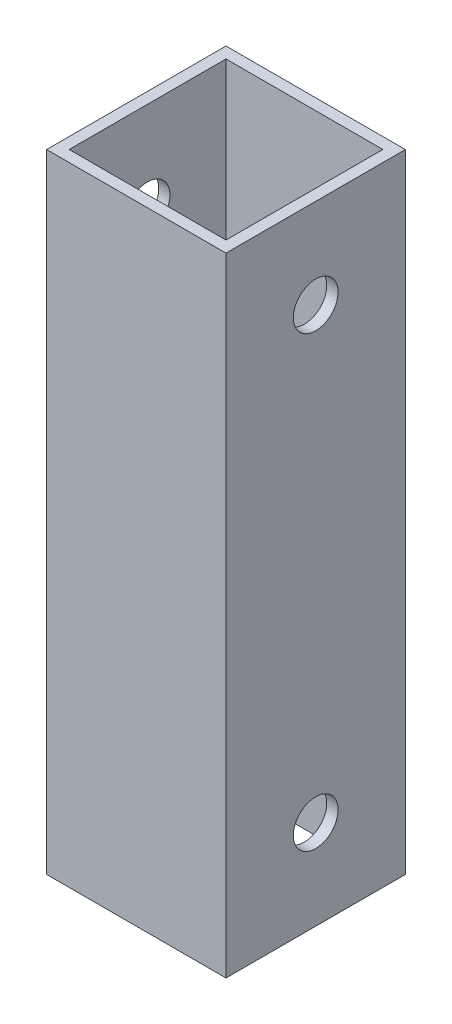
ISO-10303-21;
HEADER;
FILE_DESCRIPTION(('STEP AP214'),'2;1');
FILE_NAME('part.step','',(''),(''),'','','');
FILE_SCHEMA(('AUTOMOTIVE_DESIGN { 1 0 10303 214 1 1 1 1 }'));
ENDSEC;
DATA;
#1=APPLICATION_CONTEXT('core data for automotive mechanical design processes');
#2=APPLICATION_PROTOCOL_DEFINITION('international standard','automotive_design',2000,#1);
#3=PRODUCT_CONTEXT('',#1,'mechanical');
#4=PRODUCT('Part','Part','',(#3));
#5=PRODUCT_RELATED_PRODUCT_CATEGORY('part','',(#4));
#6=PRODUCT_DEFINITION_FORMATION('','',#4);
#7=PRODUCT_DEFINITION_CONTEXT('part definition',#1,'design');
#8=PRODUCT_DEFINITION('design','',#6,#7);
#9=PRODUCT_DEFINITION_SHAPE('','',#8);
#10=(LENGTH_UNIT() NAMED_UNIT(*) SI_UNIT(.MILLI.,.METRE.));
#11=(NAMED_UNIT(*) PLANE_ANGLE_UNIT() SI_UNIT($,.RADIAN.));
#12=(NAMED_UNIT(*) SI_UNIT($,.STERADIAN.) SOLID_ANGLE_UNIT());
#13=UNCERTAINTY_MEASURE_WITH_UNIT(LENGTH_MEASURE(1.E-05),#10,'distance_accuracy_value','');
#14=(GEOMETRIC_REPRESENTATION_CONTEXT(3) GLOBAL_UNCERTAINTY_ASSIGNED_CONTEXT((#13)) GLOBAL_UNIT_ASSIGNED_CONTEXT((#10,
#11,#12)) REPRESENTATION_CONTEXT('',''));
#15=CARTESIAN_POINT('',(0.,0.,0.));
#16=DIRECTION('',(0.,0.,1.));
#17=DIRECTION('',(1.,0.,0.));
#18=AXIS2_PLACEMENT_3D('',#15,#16,#17);
#19=CARTESIAN_POINT('',(0.,177.8,0.));
#20=DIRECTION('',(0.,1.,0.));
#21=DIRECTION('',(0.,0.,1.));
#22=AXIS2_PLACEMENT_3D('',#19,#20,#21);
#23=PLANE('',#22);
#24=DIRECTION('',(0.,0.,1.));
#25=VECTOR('',#24,1.);
#26=CARTESIAN_POINT('',(-25.4,177.8,-25.4));
#27=LINE('',#26,#25);
#28=CARTESIAN_POINT('',(-25.4,177.8,-25.4));
#29=VERTEX_POINT('',#28);
#30=CARTESIAN_POINT('',(-25.4,177.8,25.4));
#31=VERTEX_POINT('',#30);
#32=EDGE_CURVE('E138',#29,#31,#27,.T.);
#33=ORIENTED_EDGE('',*,*,#32,.T.);
#34=DIRECTION('',(1.,0.,0.));
#35=VECTOR('',#34,1.);
#36=CARTESIAN_POINT('',(-25.4,177.8,25.4));
#37=LINE('',#36,#35);
#38=CARTESIAN_POINT('',(25.4,177.8,25.4));
#39=VERTEX_POINT('',#38);
#40=EDGE_CURVE('E141',#31,#39,#37,.T.);
#41=ORIENTED_EDGE('',*,*,#40,.T.);
#42=DIRECTION('',(0.,0.,-1.));
#43=VECTOR('',#42,1.);
#44=CARTESIAN_POINT('',(25.4,177.8,-25.4));
#45=LINE('',#44,#43);
#46=CARTESIAN_POINT('',(25.4,177.8,-25.4));
#47=VERTEX_POINT('',#46);
#48=EDGE_CURVE('E144',#39,#47,#45,.T.);
#49=ORIENTED_EDGE('',*,*,#48,.T.);
#50=DIRECTION('',(-1.,0.,0.));
#51=VECTOR('',#50,1.);
#52=CARTESIAN_POINT('',(-25.4,177.8,-25.4));
#53=LINE('',#52,#51);
#54=EDGE_CURVE('E146',#47,#29,#53,.T.);
#55=ORIENTED_EDGE('',*,*,#54,.T.);
#56=EDGE_LOOP('',(#33,#41,#49,#55));
#57=FACE_BOUND('',#56,.T.);
#58=DIRECTION('',(1.,0.,0.));
#59=VECTOR('',#58,1.);
#60=CARTESIAN_POINT('',(-22.225,177.8,22.1917539267016));
#61=LINE('',#60,#59);
#62=CARTESIAN_POINT('',(-22.225,177.8,22.1917539267016));
#63=VERTEX_POINT('',#62);
#64=CARTESIAN_POINT('',(22.1917539267016,177.8,22.1917539267016));
#65=VERTEX_POINT('',#64);
#66=EDGE_CURVE('E108',#63,#65,#61,.T.);
#67=ORIENTED_EDGE('',*,*,#66,.F.);
#68=DIRECTION('',(0.,0.,1.));
#69=VECTOR('',#68,1.);
#70=CARTESIAN_POINT('',(-22.225,177.8,-22.225));
#71=LINE('',#70,#69);
#72=CARTESIAN_POINT('',(-22.225,177.8,-22.225));
#73=VERTEX_POINT('',#72);
#74=EDGE_CURVE('E100',#73,#63,#71,.T.);
#75=ORIENTED_EDGE('',*,*,#74,.F.);
#76=DIRECTION('',(-1.,0.,0.));
#77=VECTOR('',#76,1.);
#78=CARTESIAN_POINT('',(-22.225,177.8,-22.225));
#79=LINE('',#78,#77);
#80=CARTESIAN_POINT('',(22.1917539267016,177.8,-22.225));
#81=VERTEX_POINT('',#80);
#82=EDGE_CURVE('E122',#81,#73,#79,.T.);
#83=ORIENTED_EDGE('',*,*,#82,.F.);
#84=DIRECTION('',(0.,0.,-1.));
#85=VECTOR('',#84,1.);
#86=CARTESIAN_POINT('',(22.1917539267016,177.8,-22.225));
#87=LINE('',#86,#85);
#88=EDGE_CURVE('E120',#65,#81,#87,.T.);
#89=ORIENTED_EDGE('',*,*,#88,.F.);
#90=EDGE_LOOP('',(#67,#75,#83,#89));
#91=FACE_BOUND('',#90,.T.);
#92=ADVANCED_FACE('F33',(#57,#91),#23,.T.);
#93=CARTESIAN_POINT('',(0.,0.,0.));
#94=DIRECTION('',(0.,1.,0.));
#95=DIRECTION('',(0.,0.,1.));
#96=AXIS2_PLACEMENT_3D('',#93,#94,#95);
#97=PLANE('',#96);
#98=DIRECTION('',(0.,0.,1.));
#99=VECTOR('',#98,1.);
#100=CARTESIAN_POINT('',(-25.4,0.,-25.4));
#101=LINE('',#100,#99);
#102=CARTESIAN_POINT('',(-25.4,0.,-25.4));
#103=VERTEX_POINT('',#102);
#104=CARTESIAN_POINT('',(-25.4,0.,25.4));
#105=VERTEX_POINT('',#104);
#106=EDGE_CURVE('E116',#103,#105,#101,.T.);
#107=ORIENTED_EDGE('',*,*,#106,.F.);
#108=DIRECTION('',(-1.,0.,0.));
#109=VECTOR('',#108,1.);
#110=CARTESIAN_POINT('',(-25.4,0.,-25.4));
#111=LINE('',#110,#109);
#112=CARTESIAN_POINT('',(25.4,0.,-25.4));
#113=VERTEX_POINT('',#112);
#114=EDGE_CURVE('E142',#113,#103,#111,.T.);
#115=ORIENTED_EDGE('',*,*,#114,.F.);
#116=DIRECTION('',(0.,0.,-1.));
#117=VECTOR('',#116,1.);
#118=CARTESIAN_POINT('',(25.4,0.,-25.4));
#119=LINE('',#118,#117);
#120=CARTESIAN_POINT('',(25.4,0.,25.4));
#121=VERTEX_POINT('',#120);
#122=EDGE_CURVE('E153',#121,#113,#119,.T.);
#123=ORIENTED_EDGE('',*,*,#122,.F.);
#124=DIRECTION('',(1.,0.,0.));
#125=VECTOR('',#124,1.);
#126=CARTESIAN_POINT('',(-25.4,0.,25.4));
#127=LINE('',#126,#125);
#128=EDGE_CURVE('E151',#105,#121,#127,.T.);
#129=ORIENTED_EDGE('',*,*,#128,.F.);
#130=EDGE_LOOP('',(#107,#115,#123,#129));
#131=FACE_BOUND('',#130,.T.);
#132=DIRECTION('',(0.,0.,1.));
#133=VECTOR('',#132,1.);
#134=CARTESIAN_POINT('',(-22.225,0.,-22.225));
#135=LINE('',#134,#133);
#136=CARTESIAN_POINT('',(-22.225,0.,-22.225));
#137=VERTEX_POINT('',#136);
#138=CARTESIAN_POINT('',(-22.225,0.,22.1917539267016));
#139=VERTEX_POINT('',#138);
#140=EDGE_CURVE('E58',#137,#139,#135,.T.);
#141=ORIENTED_EDGE('',*,*,#140,.T.);
#142=DIRECTION('',(1.,0.,0.));
#143=VECTOR('',#142,1.);
#144=CARTESIAN_POINT('',(-22.225,0.,22.1917539267016));
#145=LINE('',#144,#143);
#146=CARTESIAN_POINT('',(22.1917539267016,0.,22.1917539267016));
#147=VERTEX_POINT('',#146);
#148=EDGE_CURVE('E115',#139,#147,#145,.T.);
#149=ORIENTED_EDGE('',*,*,#148,.T.);
#150=DIRECTION('',(0.,0.,-1.));
#151=VECTOR('',#150,1.);
#152=CARTESIAN_POINT('',(22.1917539267016,0.,-22.225));
#153=LINE('',#152,#151);
#154=CARTESIAN_POINT('',(22.1917539267016,0.,-22.225));
#155=VERTEX_POINT('',#154);
#156=EDGE_CURVE('E130',#147,#155,#153,.T.);
#157=ORIENTED_EDGE('',*,*,#156,.T.);
#158=DIRECTION('',(-1.,0.,0.));
#159=VECTOR('',#158,1.);
#160=CARTESIAN_POINT('',(-22.225,0.,-22.225));
#161=LINE('',#160,#159);
#162=EDGE_CURVE('E109',#155,#137,#161,.T.);
#163=ORIENTED_EDGE('',*,*,#162,.T.);
#164=EDGE_LOOP('',(#141,#149,#157,#163));
#165=FACE_BOUND('',#164,.T.);
#166=ADVANCED_FACE('F200',(#131,#165),#97,.F.);
#167=CARTESIAN_POINT('',(-25.4,177.8,-25.4));
#168=DIRECTION('',(1.,0.,0.));
#169=DIRECTION('',(0.,0.,-1.));
#170=AXIS2_PLACEMENT_3D('',#167,#168,#169);
#171=PLANE('',#170);
#172=CARTESIAN_POINT('',(-25.4,25.4,0.));
#173=DIRECTION('',(-1.,0.,0.));
#174=DIRECTION('',(0.,0.,1.));
#175=AXIS2_PLACEMENT_3D('',#172,#173,#174);
#176=CIRCLE('',#175,6.35);
#177=CARTESIAN_POINT('',(-25.4,25.4,6.34999999999997));
#178=VERTEX_POINT('',#177);
#179=EDGE_CURVE('E171',#178,#178,#176,.T.);
#180=ORIENTED_EDGE('',*,*,#179,.F.);
#181=EDGE_LOOP('',(#180));
#182=FACE_BOUND('',#181,.T.);
#183=CARTESIAN_POINT('',(-25.4,152.4,0.));
#184=DIRECTION('',(-1.,0.,0.));
#185=DIRECTION('',(0.,0.,1.));
#186=AXIS2_PLACEMENT_3D('',#183,#184,#185);
#187=CIRCLE('',#186,6.34999999999999);
#188=CARTESIAN_POINT('',(-25.4,152.4,6.34999999999995));
#189=VERTEX_POINT('',#188);
#190=EDGE_CURVE('E181',#189,#189,#187,.T.);
#191=ORIENTED_EDGE('',*,*,#190,.F.);
#192=EDGE_LOOP('',(#191));
#193=FACE_BOUND('',#192,.T.);
#194=ORIENTED_EDGE('',*,*,#106,.T.);
#195=DIRECTION('',(0.,-1.,0.));
#196=VECTOR('',#195,1.);
#197=CARTESIAN_POINT('',(-25.4,177.8,25.4));
#198=LINE('',#197,#196);
#199=EDGE_CURVE('E11',#31,#105,#198,.T.);
#200=ORIENTED_EDGE('',*,*,#199,.F.);
#201=ORIENTED_EDGE('',*,*,#32,.F.);
#202=DIRECTION('',(0.,-1.,0.));
#203=VECTOR('',#202,1.);
#204=CARTESIAN_POINT('',(-25.4,177.8,-25.4));
#205=LINE('',#204,#203);
#206=EDGE_CURVE('E148',#29,#103,#205,.T.);
#207=ORIENTED_EDGE('',*,*,#206,.T.);
#208=EDGE_LOOP('',(#194,#200,#201,#207));
#209=FACE_BOUND('',#208,.T.);
#210=ADVANCED_FACE('F35',(#182,#193,#209),#171,.F.);
#211=CARTESIAN_POINT('',(-25.4,177.8,25.4));
#212=DIRECTION('',(0.,0.,-1.));
#213=DIRECTION('',(-1.,0.,0.));
#214=AXIS2_PLACEMENT_3D('',#211,#212,#213);
#215=PLANE('',#214);
#216=ORIENTED_EDGE('',*,*,#128,.T.);
#217=DIRECTION('',(0.,-1.,0.));
#218=VECTOR('',#217,1.);
#219=CARTESIAN_POINT('',(25.4,177.8,25.4));
#220=LINE('',#219,#218);
#221=EDGE_CURVE('E42',#39,#121,#220,.T.);
#222=ORIENTED_EDGE('',*,*,#221,.F.);
#223=ORIENTED_EDGE('',*,*,#40,.F.);
#224=ORIENTED_EDGE('',*,*,#199,.T.);
#225=EDGE_LOOP('',(#216,#222,#223,#224));
#226=FACE_BOUND('',#225,.T.);
#227=ADVANCED_FACE('F226',(#226),#215,.F.);
#228=CARTESIAN_POINT('',(25.4,177.8,-25.4));
#229=DIRECTION('',(-1.,0.,0.));
#230=DIRECTION('',(0.,0.,1.));
#231=AXIS2_PLACEMENT_3D('',#228,#229,#230);
#232=PLANE('',#231);
#233=CARTESIAN_POINT('',(25.4,25.4,0.));
#234=DIRECTION('',(-1.,0.,0.));
#235=DIRECTION('',(0.,0.,1.));
#236=AXIS2_PLACEMENT_3D('',#233,#234,#235);
#237=CIRCLE('',#236,6.35);
#238=CARTESIAN_POINT('',(25.4,25.4,6.34999999999996));
#239=VERTEX_POINT('',#238);
#240=EDGE_CURVE('E165',#239,#239,#237,.T.);
#241=ORIENTED_EDGE('',*,*,#240,.T.);
#242=EDGE_LOOP('',(#241));
#243=FACE_BOUND('',#242,.T.);
#244=CARTESIAN_POINT('',(25.4,152.4,0.));
#245=DIRECTION('',(-1.,0.,0.));
#246=DIRECTION('',(0.,0.,1.));
#247=AXIS2_PLACEMENT_3D('',#244,#245,#246);
#248=CIRCLE('',#247,6.34999999999999);
#249=CARTESIAN_POINT('',(25.4,152.4,6.34999999999993));
#250=VERTEX_POINT('',#249);
#251=EDGE_CURVE('E176',#250,#250,#248,.T.);
#252=ORIENTED_EDGE('',*,*,#251,.T.);
#253=EDGE_LOOP('',(#252));
#254=FACE_BOUND('',#253,.T.);
#255=ORIENTED_EDGE('',*,*,#122,.T.);
#256=DIRECTION('',(0.,-1.,0.));
#257=VECTOR('',#256,1.);
#258=CARTESIAN_POINT('',(25.4,177.8,-25.4));
#259=LINE('',#258,#257);
#260=EDGE_CURVE('E158',#47,#113,#259,.T.);
#261=ORIENTED_EDGE('',*,*,#260,.F.);
#262=ORIENTED_EDGE('',*,*,#48,.F.);
#263=ORIENTED_EDGE('',*,*,#221,.T.);
#264=EDGE_LOOP('',(#255,#261,#262,#263));
#265=FACE_BOUND('',#264,.T.);
#266=ADVANCED_FACE('F223',(#243,#254,#265),#232,.F.);
#267=CARTESIAN_POINT('',(-25.4,177.8,-25.4));
#268=DIRECTION('',(0.,0.,1.));
#269=DIRECTION('',(1.,0.,0.));
#270=AXIS2_PLACEMENT_3D('',#267,#268,#269);
#271=PLANE('',#270);
#272=ORIENTED_EDGE('',*,*,#114,.T.);
#273=ORIENTED_EDGE('',*,*,#206,.F.);
#274=ORIENTED_EDGE('',*,*,#54,.F.);
#275=ORIENTED_EDGE('',*,*,#260,.T.);
#276=EDGE_LOOP('',(#272,#273,#274,#275));
#277=FACE_BOUND('',#276,.T.);
#278=ADVANCED_FACE('F220',(#277),#271,.F.);
#279=CARTESIAN_POINT('',(-22.225,177.8,-22.225));
#280=DIRECTION('',(1.,0.,0.));
#281=DIRECTION('',(0.,0.,-1.));
#282=AXIS2_PLACEMENT_3D('',#279,#280,#281);
#283=PLANE('',#282);
#284=CARTESIAN_POINT('',(-22.225,25.4,0.));
#285=DIRECTION('',(1.,0.,0.));
#286=DIRECTION('',(0.,0.,-1.));
#287=AXIS2_PLACEMENT_3D('',#284,#285,#286);
#288=CIRCLE('',#287,6.35);
#289=CARTESIAN_POINT('',(-22.225,25.4,-6.35000000000002));
#290=VERTEX_POINT('',#289);
#291=EDGE_CURVE('E128',#290,#290,#288,.T.);
#292=ORIENTED_EDGE('',*,*,#291,.F.);
#293=EDGE_LOOP('',(#292));
#294=FACE_BOUND('',#293,.T.);
#295=CARTESIAN_POINT('',(-22.225,152.4,0.));
#296=DIRECTION('',(1.,0.,0.));
#297=DIRECTION('',(0.,0.,-1.));
#298=AXIS2_PLACEMENT_3D('',#295,#296,#297);
#299=CIRCLE('',#298,6.34999999999999);
#300=CARTESIAN_POINT('',(-22.225,152.4,-6.35000000000004));
#301=VERTEX_POINT('',#300);
#302=EDGE_CURVE('E164',#301,#301,#299,.T.);
#303=ORIENTED_EDGE('',*,*,#302,.F.);
#304=EDGE_LOOP('',(#303));
#305=FACE_BOUND('',#304,.T.);
#306=ORIENTED_EDGE('',*,*,#140,.F.);
#307=DIRECTION('',(0.,-1.,0.));
#308=VECTOR('',#307,1.);
#309=CARTESIAN_POINT('',(-22.225,177.8,-22.225));
#310=LINE('',#309,#308);
#311=EDGE_CURVE('E104',#73,#137,#310,.T.);
#312=ORIENTED_EDGE('',*,*,#311,.F.);
#313=ORIENTED_EDGE('',*,*,#74,.T.);
#314=DIRECTION('',(0.,-1.,0.));
#315=VECTOR('',#314,1.);
#316=CARTESIAN_POINT('',(-22.225,177.8,22.1917539267016));
#317=LINE('',#316,#315);
#318=EDGE_CURVE('E103',#63,#139,#317,.T.);
#319=ORIENTED_EDGE('',*,*,#318,.T.);
#320=EDGE_LOOP('',(#306,#312,#313,#319));
#321=FACE_BOUND('',#320,.T.);
#322=ADVANCED_FACE('F102',(#294,#305,#321),#283,.T.);
#323=CARTESIAN_POINT('',(-22.225,177.8,22.1917539267016));
#324=DIRECTION('',(0.,0.,-1.));
#325=DIRECTION('',(-1.,0.,0.));
#326=AXIS2_PLACEMENT_3D('',#323,#324,#325);
#327=PLANE('',#326);
#328=ORIENTED_EDGE('',*,*,#148,.F.);
#329=ORIENTED_EDGE('',*,*,#318,.F.);
#330=ORIENTED_EDGE('',*,*,#66,.T.);
#331=DIRECTION('',(0.,-1.,0.));
#332=VECTOR('',#331,1.);
#333=CARTESIAN_POINT('',(22.1917539267016,177.8,22.1917539267016));
#334=LINE('',#333,#332);
#335=EDGE_CURVE('E117',#65,#147,#334,.T.);
#336=ORIENTED_EDGE('',*,*,#335,.T.);
#337=EDGE_LOOP('',(#328,#329,#330,#336));
#338=FACE_BOUND('',#337,.T.);
#339=ADVANCED_FACE('F112',(#338),#327,.T.);
#340=CARTESIAN_POINT('',(22.1917539267016,177.8,-22.225));
#341=DIRECTION('',(-1.,0.,0.));
#342=DIRECTION('',(0.,0.,1.));
#343=AXIS2_PLACEMENT_3D('',#340,#341,#342);
#344=PLANE('',#343);
#345=CARTESIAN_POINT('',(22.1917539267016,25.4,0.));
#346=DIRECTION('',(-1.,0.,0.));
#347=DIRECTION('',(0.,0.,1.));
#348=AXIS2_PLACEMENT_3D('',#345,#346,#347);
#349=CIRCLE('',#348,6.35);
#350=CARTESIAN_POINT('',(22.1917539267016,25.4,6.34999999999996));
#351=VERTEX_POINT('',#350);
#352=EDGE_CURVE('E37',#351,#351,#349,.T.);
#353=ORIENTED_EDGE('',*,*,#352,.F.);
#354=EDGE_LOOP('',(#353));
#355=FACE_BOUND('',#354,.T.);
#356=CARTESIAN_POINT('',(22.1917539267016,152.4,0.));
#357=DIRECTION('',(-1.,0.,0.));
#358=DIRECTION('',(0.,0.,1.));
#359=AXIS2_PLACEMENT_3D('',#356,#357,#358);
#360=CIRCLE('',#359,6.34999999999999);
#361=CARTESIAN_POINT('',(22.1917539267016,152.4,6.34999999999993));
#362=VERTEX_POINT('',#361);
#363=EDGE_CURVE('E162',#362,#362,#360,.T.);
#364=ORIENTED_EDGE('',*,*,#363,.F.);
#365=EDGE_LOOP('',(#364));
#366=FACE_BOUND('',#365,.T.);
#367=ORIENTED_EDGE('',*,*,#156,.F.);
#368=ORIENTED_EDGE('',*,*,#335,.F.);
#369=ORIENTED_EDGE('',*,*,#88,.T.);
#370=DIRECTION('',(0.,-1.,0.));
#371=VECTOR('',#370,1.);
#372=CARTESIAN_POINT('',(22.1917539267016,177.8,-22.225));
#373=LINE('',#372,#371);
#374=EDGE_CURVE('E50',#81,#155,#373,.T.);
#375=ORIENTED_EDGE('',*,*,#374,.T.);
#376=EDGE_LOOP('',(#367,#368,#369,#375));
#377=FACE_BOUND('',#376,.T.);
#378=ADVANCED_FACE('F192',(#355,#366,#377),#344,.T.);
#379=CARTESIAN_POINT('',(-22.225,177.8,-22.225));
#380=DIRECTION('',(0.,0.,1.));
#381=DIRECTION('',(1.,0.,0.));
#382=AXIS2_PLACEMENT_3D('',#379,#380,#381);
#383=PLANE('',#382);
#384=ORIENTED_EDGE('',*,*,#162,.F.);
#385=ORIENTED_EDGE('',*,*,#374,.F.);
#386=ORIENTED_EDGE('',*,*,#82,.T.);
#387=ORIENTED_EDGE('',*,*,#311,.T.);
#388=EDGE_LOOP('',(#384,#385,#386,#387));
#389=FACE_BOUND('',#388,.T.);
#390=ADVANCED_FACE('F195',(#389),#383,.T.);
#391=CARTESIAN_POINT('',(25.4,152.4,0.));
#392=DIRECTION('',(-1.,0.,0.));
#393=DIRECTION('',(0.,0.,1.));
#394=AXIS2_PLACEMENT_3D('',#391,#392,#393);
#395=CYLINDRICAL_SURFACE('',#394,6.34999999999999);
#396=ORIENTED_EDGE('',*,*,#363,.T.);
#397=EDGE_LOOP('',(#396));
#398=FACE_BOUND('',#397,.T.);
#399=ORIENTED_EDGE('',*,*,#251,.F.);
#400=EDGE_LOOP('',(#399));
#401=FACE_BOUND('',#400,.T.);
#402=ADVANCED_FACE('F202',(#398,#401),#395,.F.);
#403=CARTESIAN_POINT('',(25.4,25.4,0.));
#404=DIRECTION('',(-1.,0.,0.));
#405=DIRECTION('',(0.,0.,1.));
#406=AXIS2_PLACEMENT_3D('',#403,#404,#405);
#407=CYLINDRICAL_SURFACE('',#406,6.35);
#408=ORIENTED_EDGE('',*,*,#352,.T.);
#409=EDGE_LOOP('',(#408));
#410=FACE_BOUND('',#409,.T.);
#411=ORIENTED_EDGE('',*,*,#240,.F.);
#412=EDGE_LOOP('',(#411));
#413=FACE_BOUND('',#412,.T.);
#414=ADVANCED_FACE('F189',(#410,#413),#407,.F.);
#415=ORIENTED_EDGE('',*,*,#302,.T.);
#416=EDGE_LOOP('',(#415));
#417=FACE_BOUND('',#416,.T.);
#418=ORIENTED_EDGE('',*,*,#190,.T.);
#419=EDGE_LOOP('',(#418));
#420=FACE_BOUND('',#419,.T.);
#421=ADVANCED_FACE('F208',(#417,#420),#395,.F.);
#422=ORIENTED_EDGE('',*,*,#291,.T.);
#423=EDGE_LOOP('',(#422));
#424=FACE_BOUND('',#423,.T.);
#425=ORIENTED_EDGE('',*,*,#179,.T.);
#426=EDGE_LOOP('',(#425));
#427=FACE_BOUND('',#426,.T.);
#428=ADVANCED_FACE('F252',(#424,#427),#407,.F.);
#429=CLOSED_SHELL('',(#92,#166,#210,#227,#266,#278,#322,#339,#378,#390,#402,#414,#421,#428));
#430=MANIFOLD_SOLID_BREP('B2',#429);
#431=ADVANCED_BREP_SHAPE_REPRESENTATION('',(#18,#430),#14);
#432=SHAPE_DEFINITION_REPRESENTATION(#9,#431);
ENDSEC;
END-ISO-10303-21;
